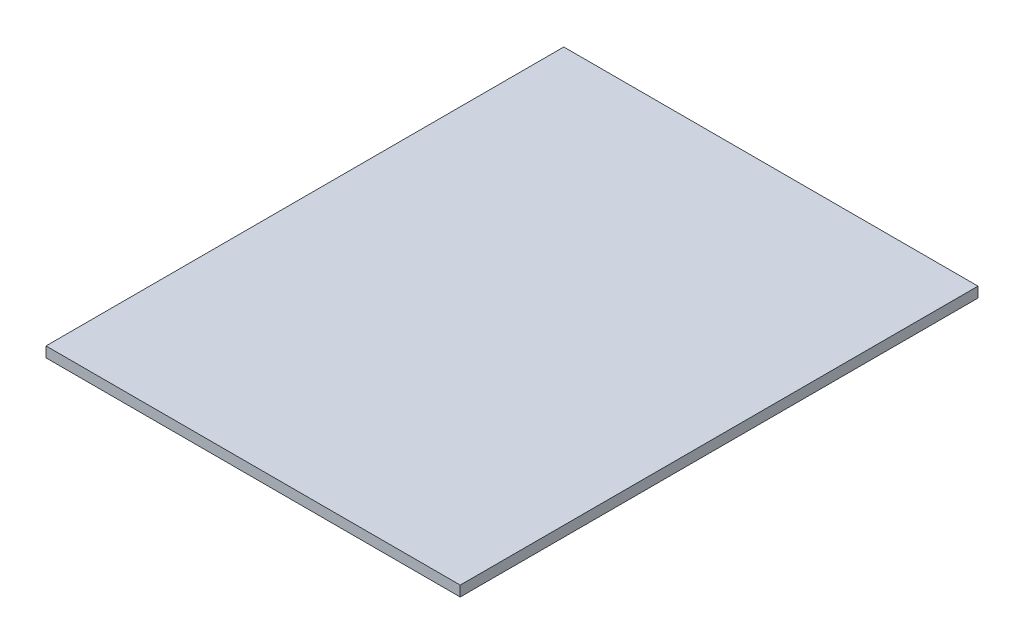
ISO-10303-21;
HEADER;
FILE_DESCRIPTION(('STEP AP214'),'2;1');
FILE_NAME('part.step','',(''),(''),'','','');
FILE_SCHEMA(('AUTOMOTIVE_DESIGN { 1 0 10303 214 1 1 1 1 }'));
ENDSEC;
DATA;
#1=APPLICATION_CONTEXT('core data for automotive mechanical design processes');
#2=APPLICATION_PROTOCOL_DEFINITION('international standard','automotive_design',2000,#1);
#3=PRODUCT_CONTEXT('',#1,'mechanical');
#4=PRODUCT('Part','Part','',(#3));
#5=PRODUCT_RELATED_PRODUCT_CATEGORY('part','',(#4));
#6=PRODUCT_DEFINITION_FORMATION('','',#4);
#7=PRODUCT_DEFINITION_CONTEXT('part definition',#1,'design');
#8=PRODUCT_DEFINITION('design','',#6,#7);
#9=PRODUCT_DEFINITION_SHAPE('','',#8);
#10=(LENGTH_UNIT() NAMED_UNIT(*) SI_UNIT(.MILLI.,.METRE.));
#11=(NAMED_UNIT(*) PLANE_ANGLE_UNIT() SI_UNIT($,.RADIAN.));
#12=(NAMED_UNIT(*) SI_UNIT($,.STERADIAN.) SOLID_ANGLE_UNIT());
#13=UNCERTAINTY_MEASURE_WITH_UNIT(LENGTH_MEASURE(1.E-05),#10,'distance_accuracy_value','');
#14=(GEOMETRIC_REPRESENTATION_CONTEXT(3) GLOBAL_UNCERTAINTY_ASSIGNED_CONTEXT((#13)) GLOBAL_UNIT_ASSIGNED_CONTEXT((#10,
#11,#12)) REPRESENTATION_CONTEXT('',''));
#15=CARTESIAN_POINT('',(0.,0.,0.));
#16=DIRECTION('',(0.,0.,1.));
#17=DIRECTION('',(1.,0.,0.));
#18=AXIS2_PLACEMENT_3D('',#15,#16,#17);
#19=CARTESIAN_POINT('',(60.,3.,-75.));
#20=DIRECTION('',(-1.,0.,0.));
#21=DIRECTION('',(0.,0.,1.));
#22=AXIS2_PLACEMENT_3D('',#19,#20,#21);
#23=PLANE('',#22);
#24=DIRECTION('',(0.,0.,-1.));
#25=VECTOR('',#24,1.);
#26=CARTESIAN_POINT('',(60.,0.,-75.));
#27=LINE('',#26,#25);
#28=CARTESIAN_POINT('',(60.,0.,75.));
#29=VERTEX_POINT('',#28);
#30=CARTESIAN_POINT('',(60.,0.,-75.));
#31=VERTEX_POINT('',#30);
#32=EDGE_CURVE('E141',#29,#31,#27,.T.);
#33=ORIENTED_EDGE('',*,*,#32,.T.);
#34=DIRECTION('',(0.,-1.,0.));
#35=VECTOR('',#34,1.);
#36=CARTESIAN_POINT('',(60.,3.,-75.));
#37=LINE('',#36,#35);
#38=CARTESIAN_POINT('',(60.,3.,-75.));
#39=VERTEX_POINT('',#38);
#40=EDGE_CURVE('E11',#39,#31,#37,.T.);
#41=ORIENTED_EDGE('',*,*,#40,.F.);
#42=DIRECTION('',(0.,0.,-1.));
#43=VECTOR('',#42,1.);
#44=CARTESIAN_POINT('',(60.,3.,-75.));
#45=LINE('',#44,#43);
#46=CARTESIAN_POINT('',(60.,3.,75.));
#47=VERTEX_POINT('',#46);
#48=EDGE_CURVE('E145',#47,#39,#45,.T.);
#49=ORIENTED_EDGE('',*,*,#48,.F.);
#50=DIRECTION('',(0.,-1.,0.));
#51=VECTOR('',#50,1.);
#52=CARTESIAN_POINT('',(60.,3.,75.));
#53=LINE('',#52,#51);
#54=EDGE_CURVE('E151',#47,#29,#53,.T.);
#55=ORIENTED_EDGE('',*,*,#54,.T.);
#56=EDGE_LOOP('',(#33,#41,#49,#55));
#57=FACE_BOUND('',#56,.T.);
#58=ADVANCED_FACE('F33',(#57),#23,.F.);
#59=CARTESIAN_POINT('',(-60.,3.,-75.));
#60=DIRECTION('',(0.,0.,1.));
#61=DIRECTION('',(1.,0.,0.));
#62=AXIS2_PLACEMENT_3D('',#59,#60,#61);
#63=PLANE('',#62);
#64=DIRECTION('',(-1.,0.,0.));
#65=VECTOR('',#64,1.);
#66=CARTESIAN_POINT('',(-60.,0.,-75.));
#67=LINE('',#66,#65);
#68=CARTESIAN_POINT('',(-60.,0.,-75.));
#69=VERTEX_POINT('',#68);
#70=EDGE_CURVE('E154',#31,#69,#67,.T.);
#71=ORIENTED_EDGE('',*,*,#70,.T.);
#72=DIRECTION('',(0.,-1.,0.));
#73=VECTOR('',#72,1.);
#74=CARTESIAN_POINT('',(-60.,3.,-75.));
#75=LINE('',#74,#73);
#76=CARTESIAN_POINT('',(-60.,3.,-75.));
#77=VERTEX_POINT('',#76);
#78=EDGE_CURVE('E40',#77,#69,#75,.T.);
#79=ORIENTED_EDGE('',*,*,#78,.F.);
#80=DIRECTION('',(-1.,0.,0.));
#81=VECTOR('',#80,1.);
#82=CARTESIAN_POINT('',(-60.,3.,-75.));
#83=LINE('',#82,#81);
#84=EDGE_CURVE('E84',#39,#77,#83,.T.);
#85=ORIENTED_EDGE('',*,*,#84,.F.);
#86=ORIENTED_EDGE('',*,*,#40,.T.);
#87=EDGE_LOOP('',(#71,#79,#85,#86));
#88=FACE_BOUND('',#87,.T.);
#89=ADVANCED_FACE('F182',(#88),#63,.F.);
#90=CARTESIAN_POINT('',(-60.,3.,-75.));
#91=DIRECTION('',(1.,0.,0.));
#92=DIRECTION('',(0.,0.,-1.));
#93=AXIS2_PLACEMENT_3D('',#90,#91,#92);
#94=PLANE('',#93);
#95=DIRECTION('',(0.,0.,1.));
#96=VECTOR('',#95,1.);
#97=CARTESIAN_POINT('',(-60.,0.,-75.));
#98=LINE('',#97,#96);
#99=CARTESIAN_POINT('',(-60.,0.,75.));
#100=VERTEX_POINT('',#99);
#101=EDGE_CURVE('E156',#69,#100,#98,.T.);
#102=ORIENTED_EDGE('',*,*,#101,.T.);
#103=DIRECTION('',(0.,-1.,0.));
#104=VECTOR('',#103,1.);
#105=CARTESIAN_POINT('',(-60.,3.,75.));
#106=LINE('',#105,#104);
#107=CARTESIAN_POINT('',(-60.,3.,75.));
#108=VERTEX_POINT('',#107);
#109=EDGE_CURVE('E160',#108,#100,#106,.T.);
#110=ORIENTED_EDGE('',*,*,#109,.F.);
#111=DIRECTION('',(0.,0.,1.));
#112=VECTOR('',#111,1.);
#113=CARTESIAN_POINT('',(-60.,3.,-75.));
#114=LINE('',#113,#112);
#115=EDGE_CURVE('E148',#77,#108,#114,.T.);
#116=ORIENTED_EDGE('',*,*,#115,.F.);
#117=ORIENTED_EDGE('',*,*,#78,.T.);
#118=EDGE_LOOP('',(#102,#110,#116,#117));
#119=FACE_BOUND('',#118,.T.);
#120=ADVANCED_FACE('F165',(#119),#94,.F.);
#121=CARTESIAN_POINT('',(-60.,3.,75.));
#122=DIRECTION('',(0.,0.,-1.));
#123=DIRECTION('',(-1.,0.,0.));
#124=AXIS2_PLACEMENT_3D('',#121,#122,#123);
#125=PLANE('',#124);
#126=DIRECTION('',(1.,0.,0.));
#127=VECTOR('',#126,1.);
#128=CARTESIAN_POINT('',(-60.,0.,75.));
#129=LINE('',#128,#127);
#130=EDGE_CURVE('E77',#100,#29,#129,.T.);
#131=ORIENTED_EDGE('',*,*,#130,.T.);
#132=ORIENTED_EDGE('',*,*,#54,.F.);
#133=DIRECTION('',(1.,0.,0.));
#134=VECTOR('',#133,1.);
#135=CARTESIAN_POINT('',(-60.,3.,75.));
#136=LINE('',#135,#134);
#137=EDGE_CURVE('E56',#108,#47,#136,.T.);
#138=ORIENTED_EDGE('',*,*,#137,.F.);
#139=ORIENTED_EDGE('',*,*,#109,.T.);
#140=EDGE_LOOP('',(#131,#132,#138,#139));
#141=FACE_BOUND('',#140,.T.);
#142=ADVANCED_FACE('F173',(#141),#125,.F.);
#143=CARTESIAN_POINT('',(0.,3.,0.));
#144=DIRECTION('',(0.,1.,0.));
#145=DIRECTION('',(0.,0.,1.));
#146=AXIS2_PLACEMENT_3D('',#143,#144,#145);
#147=PLANE('',#146);
#148=ORIENTED_EDGE('',*,*,#48,.T.);
#149=ORIENTED_EDGE('',*,*,#84,.T.);
#150=ORIENTED_EDGE('',*,*,#115,.T.);
#151=ORIENTED_EDGE('',*,*,#137,.T.);
#152=EDGE_LOOP('',(#148,#149,#150,#151));
#153=FACE_BOUND('',#152,.T.);
#154=ADVANCED_FACE('F175',(#153),#147,.T.);
#155=CARTESIAN_POINT('',(0.,0.,0.));
#156=DIRECTION('',(0.,1.,0.));
#157=DIRECTION('',(0.,0.,1.));
#158=AXIS2_PLACEMENT_3D('',#155,#156,#157);
#159=PLANE('',#158);
#160=DIRECTION('',(0.,0.,1.));
#161=VECTOR('',#160,1.);
#162=CARTESIAN_POINT('',(50.,0.,0.));
#163=LINE('',#162,#161);
#164=CARTESIAN_POINT('',(50.,0.,-65.));
#165=VERTEX_POINT('',#164);
#166=CARTESIAN_POINT('',(50.,0.,65.));
#167=VERTEX_POINT('',#166);
#168=EDGE_CURVE('E135',#165,#167,#163,.T.);
#169=ORIENTED_EDGE('',*,*,#168,.F.);
#170=DIRECTION('',(1.,0.,0.));
#171=VECTOR('',#170,1.);
#172=CARTESIAN_POINT('',(0.,0.,-65.));
#173=LINE('',#172,#171);
#174=CARTESIAN_POINT('',(-50.,0.,-65.));
#175=VERTEX_POINT('',#174);
#176=EDGE_CURVE('E47',#175,#165,#173,.T.);
#177=ORIENTED_EDGE('',*,*,#176,.F.);
#178=DIRECTION('',(0.,0.,-1.));
#179=VECTOR('',#178,1.);
#180=CARTESIAN_POINT('',(-50.,0.,0.));
#181=LINE('',#180,#179);
#182=CARTESIAN_POINT('',(-50.,0.,65.));
#183=VERTEX_POINT('',#182);
#184=EDGE_CURVE('E126',#183,#175,#181,.T.);
#185=ORIENTED_EDGE('',*,*,#184,.F.);
#186=DIRECTION('',(-1.,0.,0.));
#187=VECTOR('',#186,1.);
#188=CARTESIAN_POINT('',(0.,0.,65.));
#189=LINE('',#188,#187);
#190=EDGE_CURVE('E129',#167,#183,#189,.T.);
#191=ORIENTED_EDGE('',*,*,#190,.F.);
#192=EDGE_LOOP('',(#169,#177,#185,#191));
#193=FACE_BOUND('',#192,.T.);
#194=ORIENTED_EDGE('',*,*,#32,.F.);
#195=ORIENTED_EDGE('',*,*,#130,.F.);
#196=ORIENTED_EDGE('',*,*,#101,.F.);
#197=ORIENTED_EDGE('',*,*,#70,.F.);
#198=EDGE_LOOP('',(#194,#195,#196,#197));
#199=FACE_BOUND('',#198,.T.);
#200=ADVANCED_FACE('F169',(#193,#199),#159,.F.);
#201=CARTESIAN_POINT('',(0.,0.18,-65.));
#202=DIRECTION('',(0.,0.,-1.));
#203=DIRECTION('',(-1.,0.,0.));
#204=AXIS2_PLACEMENT_3D('',#201,#202,#203);
#205=PLANE('',#204);
#206=ORIENTED_EDGE('',*,*,#176,.T.);
#207=DIRECTION('',(0.,-1.,0.));
#208=VECTOR('',#207,1.);
#209=CARTESIAN_POINT('',(50.,0.18,-65.));
#210=LINE('',#209,#208);
#211=CARTESIAN_POINT('',(50.,0.18,-65.));
#212=VERTEX_POINT('',#211);
#213=EDGE_CURVE('E104',#212,#165,#210,.T.);
#214=ORIENTED_EDGE('',*,*,#213,.F.);
#215=DIRECTION('',(1.,0.,0.));
#216=VECTOR('',#215,1.);
#217=CARTESIAN_POINT('',(0.,0.18,-65.));
#218=LINE('',#217,#216);
#219=CARTESIAN_POINT('',(-50.,0.18,-65.));
#220=VERTEX_POINT('',#219);
#221=EDGE_CURVE('E108',#220,#212,#218,.T.);
#222=ORIENTED_EDGE('',*,*,#221,.F.);
#223=DIRECTION('',(0.,-1.,0.));
#224=VECTOR('',#223,1.);
#225=CARTESIAN_POINT('',(-50.,0.18,-65.));
#226=LINE('',#225,#224);
#227=EDGE_CURVE('E139',#220,#175,#226,.T.);
#228=ORIENTED_EDGE('',*,*,#227,.T.);
#229=EDGE_LOOP('',(#206,#214,#222,#228));
#230=FACE_BOUND('',#229,.T.);
#231=ADVANCED_FACE('F106',(#230),#205,.F.);
#232=CARTESIAN_POINT('',(-50.,0.18,0.));
#233=DIRECTION('',(-1.,0.,0.));
#234=DIRECTION('',(0.,0.,1.));
#235=AXIS2_PLACEMENT_3D('',#232,#233,#234);
#236=PLANE('',#235);
#237=ORIENTED_EDGE('',*,*,#184,.T.);
#238=ORIENTED_EDGE('',*,*,#227,.F.);
#239=DIRECTION('',(0.,0.,-1.));
#240=VECTOR('',#239,1.);
#241=CARTESIAN_POINT('',(-50.,0.18,0.));
#242=LINE('',#241,#240);
#243=CARTESIAN_POINT('',(-50.,0.18,65.));
#244=VERTEX_POINT('',#243);
#245=EDGE_CURVE('E114',#244,#220,#242,.T.);
#246=ORIENTED_EDGE('',*,*,#245,.F.);
#247=DIRECTION('',(0.,-1.,0.));
#248=VECTOR('',#247,1.);
#249=CARTESIAN_POINT('',(-50.,0.18,65.));
#250=LINE('',#249,#248);
#251=EDGE_CURVE('E142',#244,#183,#250,.T.);
#252=ORIENTED_EDGE('',*,*,#251,.T.);
#253=EDGE_LOOP('',(#237,#238,#246,#252));
#254=FACE_BOUND('',#253,.T.);
#255=ADVANCED_FACE('F220',(#254),#236,.F.);
#256=CARTESIAN_POINT('',(0.,0.18,65.));
#257=DIRECTION('',(0.,0.,1.));
#258=DIRECTION('',(1.,0.,0.));
#259=AXIS2_PLACEMENT_3D('',#256,#257,#258);
#260=PLANE('',#259);
#261=ORIENTED_EDGE('',*,*,#190,.T.);
#262=ORIENTED_EDGE('',*,*,#251,.F.);
#263=DIRECTION('',(-1.,0.,0.));
#264=VECTOR('',#263,1.);
#265=CARTESIAN_POINT('',(0.,0.18,65.));
#266=LINE('',#265,#264);
#267=CARTESIAN_POINT('',(50.,0.18,65.));
#268=VERTEX_POINT('',#267);
#269=EDGE_CURVE('E122',#268,#244,#266,.T.);
#270=ORIENTED_EDGE('',*,*,#269,.F.);
#271=DIRECTION('',(0.,-1.,0.));
#272=VECTOR('',#271,1.);
#273=CARTESIAN_POINT('',(50.,0.18,65.));
#274=LINE('',#273,#272);
#275=EDGE_CURVE('E113',#268,#167,#274,.T.);
#276=ORIENTED_EDGE('',*,*,#275,.T.);
#277=EDGE_LOOP('',(#261,#262,#270,#276));
#278=FACE_BOUND('',#277,.T.);
#279=ADVANCED_FACE('F229',(#278),#260,.F.);
#280=CARTESIAN_POINT('',(50.,0.18,0.));
#281=DIRECTION('',(1.,0.,0.));
#282=DIRECTION('',(0.,0.,-1.));
#283=AXIS2_PLACEMENT_3D('',#280,#281,#282);
#284=PLANE('',#283);
#285=ORIENTED_EDGE('',*,*,#168,.T.);
#286=ORIENTED_EDGE('',*,*,#275,.F.);
#287=DIRECTION('',(0.,0.,1.));
#288=VECTOR('',#287,1.);
#289=CARTESIAN_POINT('',(50.,0.18,0.));
#290=LINE('',#289,#288);
#291=EDGE_CURVE('E117',#212,#268,#290,.T.);
#292=ORIENTED_EDGE('',*,*,#291,.F.);
#293=ORIENTED_EDGE('',*,*,#213,.T.);
#294=EDGE_LOOP('',(#285,#286,#292,#293));
#295=FACE_BOUND('',#294,.T.);
#296=ADVANCED_FACE('F118',(#295),#284,.F.);
#297=CARTESIAN_POINT('',(0.,0.18,0.));
#298=DIRECTION('',(0.,-1.,0.));
#299=DIRECTION('',(0.,0.,-1.));
#300=AXIS2_PLACEMENT_3D('',#297,#298,#299);
#301=PLANE('',#300);
#302=ORIENTED_EDGE('',*,*,#221,.T.);
#303=ORIENTED_EDGE('',*,*,#291,.T.);
#304=ORIENTED_EDGE('',*,*,#269,.T.);
#305=ORIENTED_EDGE('',*,*,#245,.T.);
#306=EDGE_LOOP('',(#302,#303,#304,#305));
#307=FACE_BOUND('',#306,.T.);
#308=ADVANCED_FACE('F124',(#307),#301,.T.);
#309=CLOSED_SHELL('',(#58,#89,#120,#142,#154,#200,#231,#255,#279,#296,#308));
#310=MANIFOLD_SOLID_BREP('B2',#309);
#311=ADVANCED_BREP_SHAPE_REPRESENTATION('',(#18,#310),#14);
#312=SHAPE_DEFINITION_REPRESENTATION(#9,#311);
ENDSEC;
END-ISO-10303-21;
